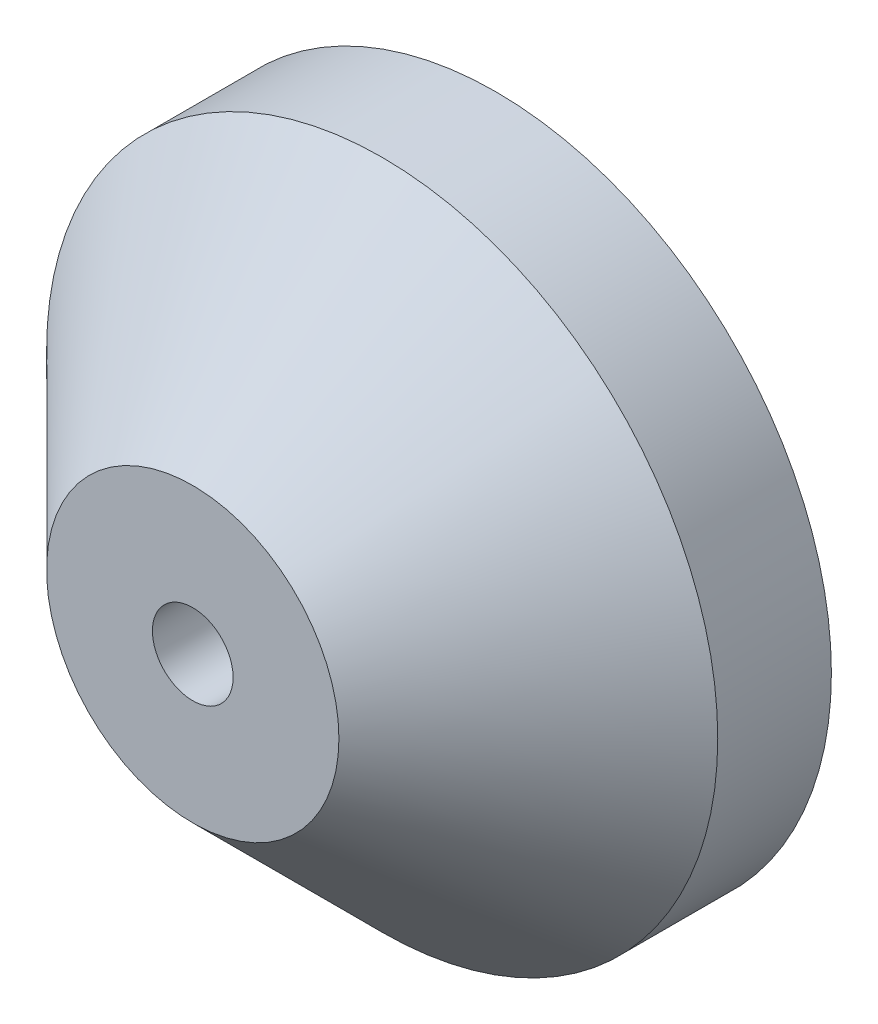
ISO-10303-21;
HEADER;
FILE_DESCRIPTION(('STEP AP214'),'2;1');
FILE_NAME('part.step','',(''),(''),'','','');
FILE_SCHEMA(('AUTOMOTIVE_DESIGN { 1 0 10303 214 1 1 1 1 }'));
ENDSEC;
DATA;
#1=APPLICATION_CONTEXT('core data for automotive mechanical design processes');
#2=APPLICATION_PROTOCOL_DEFINITION('international standard','automotive_design',2000,#1);
#3=PRODUCT_CONTEXT('',#1,'mechanical');
#4=PRODUCT('Part','Part','',(#3));
#5=PRODUCT_RELATED_PRODUCT_CATEGORY('part','',(#4));
#6=PRODUCT_DEFINITION_FORMATION('','',#4);
#7=PRODUCT_DEFINITION_CONTEXT('part definition',#1,'design');
#8=PRODUCT_DEFINITION('design','',#6,#7);
#9=PRODUCT_DEFINITION_SHAPE('','',#8);
#10=(LENGTH_UNIT() NAMED_UNIT(*) SI_UNIT(.MILLI.,.METRE.));
#11=(NAMED_UNIT(*) PLANE_ANGLE_UNIT() SI_UNIT($,.RADIAN.));
#12=(NAMED_UNIT(*) SI_UNIT($,.STERADIAN.) SOLID_ANGLE_UNIT());
#13=UNCERTAINTY_MEASURE_WITH_UNIT(LENGTH_MEASURE(1.E-05),#10,'distance_accuracy_value','');
#14=(GEOMETRIC_REPRESENTATION_CONTEXT(3) GLOBAL_UNCERTAINTY_ASSIGNED_CONTEXT((#13)) GLOBAL_UNIT_ASSIGNED_CONTEXT((#10,
#11,#12)) REPRESENTATION_CONTEXT('',''));
#15=CARTESIAN_POINT('',(0.,0.,0.));
#16=DIRECTION('',(0.,0.,1.));
#17=DIRECTION('',(1.,0.,0.));
#18=AXIS2_PLACEMENT_3D('',#15,#16,#17);
#19=CARTESIAN_POINT('',(0.,0.,-20.32));
#20=DIRECTION('',(0.,0.,1.));
#21=DIRECTION('',(1.,0.,0.));
#22=AXIS2_PLACEMENT_3D('',#19,#20,#21);
#23=CYLINDRICAL_SURFACE('',#22,22.5);
#24=CARTESIAN_POINT('',(0.,0.,-12.7));
#25=DIRECTION('',(0.,0.,1.));
#26=DIRECTION('',(1.,0.,0.));
#27=AXIS2_PLACEMENT_3D('',#24,#25,#26);
#28=CIRCLE('',#27,22.5);
#29=CARTESIAN_POINT('',(22.5,0.,-12.7));
#30=VERTEX_POINT('',#29);
#31=EDGE_CURVE('E10',#30,#30,#28,.F.);
#32=ORIENTED_EDGE('',*,*,#31,.T.);
#33=EDGE_LOOP('',(#32));
#34=FACE_BOUND('',#33,.T.);
#35=CARTESIAN_POINT('',(0.,0.,-20.32));
#36=DIRECTION('',(0.,0.,1.));
#37=DIRECTION('',(1.,0.,0.));
#38=AXIS2_PLACEMENT_3D('',#35,#36,#37);
#39=CIRCLE('',#38,22.5);
#40=CARTESIAN_POINT('',(22.5,0.,-20.32));
#41=VERTEX_POINT('',#40);
#42=EDGE_CURVE('E54',#41,#41,#39,.T.);
#43=ORIENTED_EDGE('',*,*,#42,.T.);
#44=EDGE_LOOP('',(#43));
#45=FACE_BOUND('',#44,.T.);
#46=ADVANCED_FACE('F43',(#34,#45),#23,.T.);
#47=CARTESIAN_POINT('',(0.,0.,-20.32));
#48=DIRECTION('',(0.,0.,1.));
#49=DIRECTION('',(1.,0.,0.));
#50=AXIS2_PLACEMENT_3D('',#47,#48,#49);
#51=PLANE('',#50);
#52=CARTESIAN_POINT('',(0.,0.,-20.32));
#53=DIRECTION('',(0.,0.,-1.));
#54=DIRECTION('',(-1.,0.,0.));
#55=AXIS2_PLACEMENT_3D('',#52,#53,#54);
#56=CIRCLE('',#55,17.5);
#57=CARTESIAN_POINT('',(-17.5,0.,-20.32));
#58=VERTEX_POINT('',#57);
#59=EDGE_CURVE('E61',#58,#58,#56,.T.);
#60=ORIENTED_EDGE('',*,*,#59,.F.);
#61=EDGE_LOOP('',(#60));
#62=FACE_BOUND('',#61,.T.);
#63=ORIENTED_EDGE('',*,*,#42,.F.);
#64=EDGE_LOOP('',(#63));
#65=FACE_BOUND('',#64,.T.);
#66=ADVANCED_FACE('F79',(#62,#65),#51,.F.);
#67=CARTESIAN_POINT('',(0.,0.,0.));
#68=DIRECTION('',(0.,0.,1.));
#69=DIRECTION('',(1.,0.,0.));
#70=AXIS2_PLACEMENT_3D('',#67,#68,#69);
#71=PLANE('',#70);
#72=CARTESIAN_POINT('',(0.,0.,0.));
#73=DIRECTION('',(0.,0.,1.));
#74=DIRECTION('',(1.,0.,0.));
#75=AXIS2_PLACEMENT_3D('',#72,#73,#74);
#76=CIRCLE('',#75,9.80000000000002);
#77=CARTESIAN_POINT('',(9.80000000000002,0.,0.));
#78=VERTEX_POINT('',#77);
#79=EDGE_CURVE('E50',#78,#78,#76,.T.);
#80=ORIENTED_EDGE('',*,*,#79,.T.);
#81=EDGE_LOOP('',(#80));
#82=FACE_BOUND('',#81,.T.);
#83=CARTESIAN_POINT('',(0.,0.,0.));
#84=DIRECTION('',(0.,0.,1.));
#85=DIRECTION('',(1.,0.,0.));
#86=AXIS2_PLACEMENT_3D('',#83,#84,#85);
#87=CIRCLE('',#86,2.7051);
#88=CARTESIAN_POINT('',(2.7051,0.,0.));
#89=VERTEX_POINT('',#88);
#90=EDGE_CURVE('E69',#89,#89,#87,.T.);
#91=ORIENTED_EDGE('',*,*,#90,.F.);
#92=EDGE_LOOP('',(#91));
#93=FACE_BOUND('',#92,.T.);
#94=ADVANCED_FACE('F76',(#82,#93),#71,.T.);
#95=CARTESIAN_POINT('',(0.,0.,-9.31999999999999));
#96=DIRECTION('',(0.,0.,-1.));
#97=DIRECTION('',(-1.,0.,0.));
#98=AXIS2_PLACEMENT_3D('',#95,#96,#97);
#99=CYLINDRICAL_SURFACE('',#98,17.5);
#100=CARTESIAN_POINT('',(0.,0.,-9.31999999999999));
#101=DIRECTION('',(0.,0.,-1.));
#102=DIRECTION('',(-1.,0.,0.));
#103=AXIS2_PLACEMENT_3D('',#100,#101,#102);
#104=CIRCLE('',#103,17.5);
#105=CARTESIAN_POINT('',(-17.5,0.,-9.31999999999999));
#106=VERTEX_POINT('',#105);
#107=EDGE_CURVE('E58',#106,#106,#104,.T.);
#108=ORIENTED_EDGE('',*,*,#107,.F.);
#109=EDGE_LOOP('',(#108));
#110=FACE_BOUND('',#109,.T.);
#111=ORIENTED_EDGE('',*,*,#59,.T.);
#112=EDGE_LOOP('',(#111));
#113=FACE_BOUND('',#112,.T.);
#114=ADVANCED_FACE('F78',(#110,#113),#99,.F.);
#115=CARTESIAN_POINT('',(0.,0.,-9.31999999999999));
#116=DIRECTION('',(0.,0.,-1.));
#117=DIRECTION('',(-1.,0.,0.));
#118=AXIS2_PLACEMENT_3D('',#115,#116,#117);
#119=PLANE('',#118);
#120=CARTESIAN_POINT('',(0.,0.,-9.31999999999999));
#121=DIRECTION('',(0.,0.,-1.));
#122=DIRECTION('',(-1.,0.,0.));
#123=AXIS2_PLACEMENT_3D('',#120,#121,#122);
#124=CIRCLE('',#123,2.7051);
#125=CARTESIAN_POINT('',(-2.7051,0.,-9.31999999999999));
#126=VERTEX_POINT('',#125);
#127=EDGE_CURVE('E64',#126,#126,#124,.T.);
#128=ORIENTED_EDGE('',*,*,#127,.F.);
#129=EDGE_LOOP('',(#128));
#130=FACE_BOUND('',#129,.T.);
#131=ORIENTED_EDGE('',*,*,#107,.T.);
#132=EDGE_LOOP('',(#131));
#133=FACE_BOUND('',#132,.T.);
#134=ADVANCED_FACE('F85',(#130,#133),#119,.T.);
#135=CARTESIAN_POINT('',(0.,0.,0.));
#136=DIRECTION('',(0.,0.,1.));
#137=DIRECTION('',(1.,0.,0.));
#138=AXIS2_PLACEMENT_3D('',#135,#136,#137);
#139=CYLINDRICAL_SURFACE('',#138,2.7051);
#140=ORIENTED_EDGE('',*,*,#90,.T.);
#141=EDGE_LOOP('',(#140));
#142=FACE_BOUND('',#141,.T.);
#143=ORIENTED_EDGE('',*,*,#127,.T.);
#144=EDGE_LOOP('',(#143));
#145=FACE_BOUND('',#144,.T.);
#146=ADVANCED_FACE('F73',(#142,#145),#139,.F.);
#147=CARTESIAN_POINT('',(0.,0.,0.));
#148=DIRECTION('',(0.,0.,-1.));
#149=DIRECTION('',(-1.,0.,0.));
#150=AXIS2_PLACEMENT_3D('',#147,#148,#149);
#151=CONICAL_SURFACE('',#150,9.80000000000002,0.785398163397446);
#152=ORIENTED_EDGE('',*,*,#31,.F.);
#153=EDGE_LOOP('',(#152));
#154=FACE_BOUND('',#153,.T.);
#155=ORIENTED_EDGE('',*,*,#79,.F.);
#156=EDGE_LOOP('',(#155));
#157=FACE_BOUND('',#156,.T.);
#158=ADVANCED_FACE('F45',(#154,#157),#151,.T.);
#159=CLOSED_SHELL('',(#46,#66,#94,#114,#134,#146,#158));
#160=MANIFOLD_SOLID_BREP('B2',#159);
#161=ADVANCED_BREP_SHAPE_REPRESENTATION('',(#18,#160),#14);
#162=SHAPE_DEFINITION_REPRESENTATION(#9,#161);
ENDSEC;
END-ISO-10303-21;
